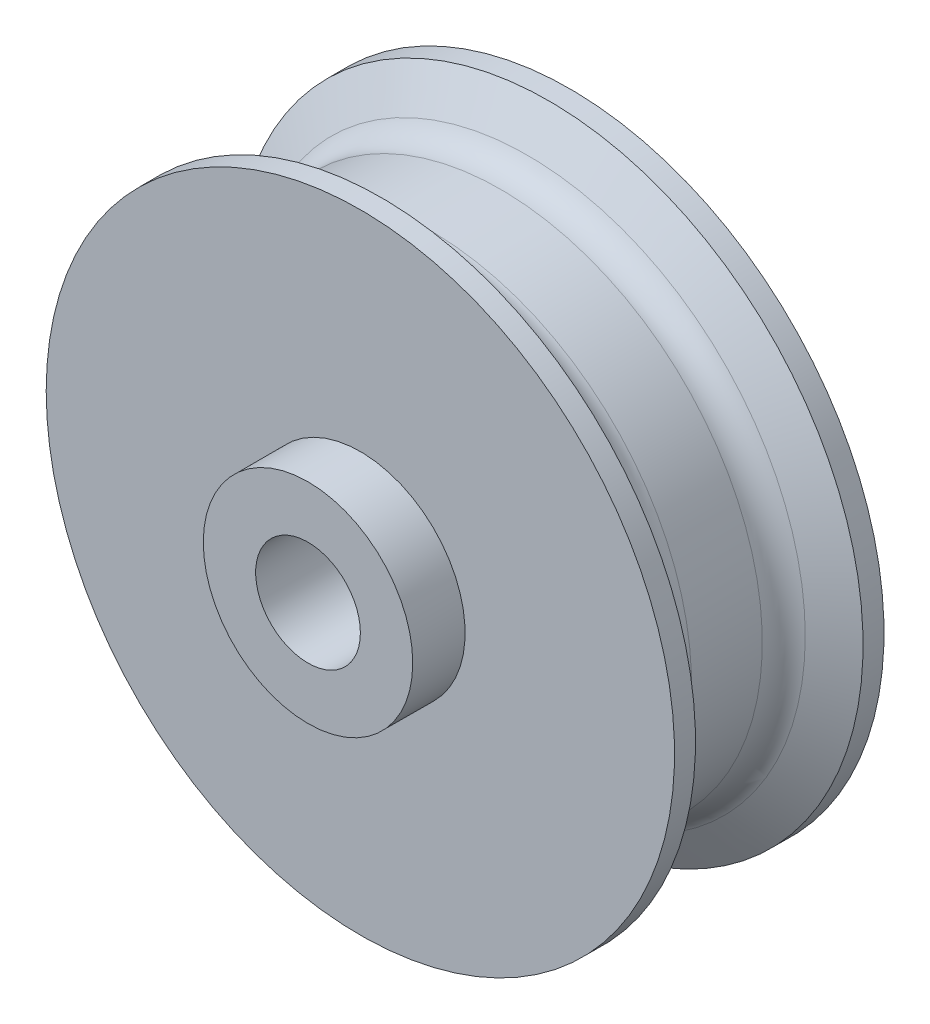
ISO-10303-21;
HEADER;
FILE_DESCRIPTION(('STEP AP214'),'2;1');
FILE_NAME('part.step','',(''),(''),'','','');
FILE_SCHEMA(('AUTOMOTIVE_DESIGN { 1 0 10303 214 1 1 1 1 }'));
ENDSEC;
DATA;
#1=APPLICATION_CONTEXT('core data for automotive mechanical design processes');
#2=APPLICATION_PROTOCOL_DEFINITION('international standard','automotive_design',2000,#1);
#3=PRODUCT_CONTEXT('',#1,'mechanical');
#4=PRODUCT('Part','Part','',(#3));
#5=PRODUCT_RELATED_PRODUCT_CATEGORY('part','',(#4));
#6=PRODUCT_DEFINITION_FORMATION('','',#4);
#7=PRODUCT_DEFINITION_CONTEXT('part definition',#1,'design');
#8=PRODUCT_DEFINITION('design','',#6,#7);
#9=PRODUCT_DEFINITION_SHAPE('','',#8);
#10=(LENGTH_UNIT() NAMED_UNIT(*) SI_UNIT(.MILLI.,.METRE.));
#11=(NAMED_UNIT(*) PLANE_ANGLE_UNIT() SI_UNIT($,.RADIAN.));
#12=(NAMED_UNIT(*) SI_UNIT($,.STERADIAN.) SOLID_ANGLE_UNIT());
#13=UNCERTAINTY_MEASURE_WITH_UNIT(LENGTH_MEASURE(1.E-05),#10,'distance_accuracy_value','');
#14=(GEOMETRIC_REPRESENTATION_CONTEXT(3) GLOBAL_UNCERTAINTY_ASSIGNED_CONTEXT((#13)) GLOBAL_UNIT_ASSIGNED_CONTEXT((#10,
#11,#12)) REPRESENTATION_CONTEXT('',''));
#15=CARTESIAN_POINT('',(0.,0.,0.));
#16=DIRECTION('',(0.,0.,1.));
#17=DIRECTION('',(1.,0.,0.));
#18=AXIS2_PLACEMENT_3D('',#15,#16,#17);
#19=CARTESIAN_POINT('',(0.,0.,30.));
#20=DIRECTION('',(0.,0.,-1.));
#21=DIRECTION('',(-1.,0.,0.));
#22=AXIS2_PLACEMENT_3D('',#19,#20,#21);
#23=CYLINDRICAL_SURFACE('',#22,10.);
#24=CARTESIAN_POINT('',(0.,0.,30.));
#25=DIRECTION('',(0.,0.,1.));
#26=DIRECTION('',(1.,0.,0.));
#27=AXIS2_PLACEMENT_3D('',#24,#25,#26);
#28=CIRCLE('',#27,10.);
#29=CARTESIAN_POINT('',(10.,0.,30.));
#30=VERTEX_POINT('',#29);
#31=EDGE_CURVE('E71',#30,#30,#28,.T.);
#32=ORIENTED_EDGE('',*,*,#31,.F.);
#33=EDGE_LOOP('',(#32));
#34=FACE_BOUND('',#33,.T.);
#35=CARTESIAN_POINT('',(0.,0.,25.));
#36=DIRECTION('',(0.,0.,-1.));
#37=DIRECTION('',(-1.,0.,0.));
#38=AXIS2_PLACEMENT_3D('',#35,#36,#37);
#39=CIRCLE('',#38,10.);
#40=CARTESIAN_POINT('',(-10.,0.,25.));
#41=VERTEX_POINT('',#40);
#42=EDGE_CURVE('E67',#41,#41,#39,.T.);
#43=ORIENTED_EDGE('',*,*,#42,.F.);
#44=EDGE_LOOP('',(#43));
#45=FACE_BOUND('',#44,.T.);
#46=ADVANCED_FACE('F43',(#34,#45),#23,.T.);
#47=CARTESIAN_POINT('',(0.,0.,30.));
#48=DIRECTION('',(0.,0.,1.));
#49=DIRECTION('',(1.,0.,0.));
#50=AXIS2_PLACEMENT_3D('',#47,#48,#49);
#51=PLANE('',#50);
#52=ORIENTED_EDGE('',*,*,#31,.T.);
#53=EDGE_LOOP('',(#52));
#54=FACE_BOUND('',#53,.T.);
#55=CARTESIAN_POINT('',(0.,0.,30.));
#56=DIRECTION('',(0.,0.,1.));
#57=DIRECTION('',(1.,0.,0.));
#58=AXIS2_PLACEMENT_3D('',#55,#56,#57);
#59=CIRCLE('',#58,5.);
#60=CARTESIAN_POINT('',(5.,0.,30.));
#61=VERTEX_POINT('',#60);
#62=EDGE_CURVE('E76',#61,#61,#59,.T.);
#63=ORIENTED_EDGE('',*,*,#62,.F.);
#64=EDGE_LOOP('',(#63));
#65=FACE_BOUND('',#64,.T.);
#66=ADVANCED_FACE('F119',(#54,#65),#51,.T.);
#67=CARTESIAN_POINT('',(0.,0.,0.));
#68=DIRECTION('',(0.,0.,1.));
#69=DIRECTION('',(1.,0.,0.));
#70=AXIS2_PLACEMENT_3D('',#67,#68,#69);
#71=PLANE('',#70);
#72=CARTESIAN_POINT('',(0.,0.,0.));
#73=DIRECTION('',(0.,0.,1.));
#74=DIRECTION('',(1.,0.,0.));
#75=AXIS2_PLACEMENT_3D('',#72,#73,#74);
#76=CIRCLE('',#75,10.);
#77=CARTESIAN_POINT('',(10.,0.,0.));
#78=VERTEX_POINT('',#77);
#79=EDGE_CURVE('E72',#78,#78,#76,.T.);
#80=ORIENTED_EDGE('',*,*,#79,.F.);
#81=EDGE_LOOP('',(#80));
#82=FACE_BOUND('',#81,.T.);
#83=CARTESIAN_POINT('',(0.,0.,0.));
#84=DIRECTION('',(0.,0.,1.));
#85=DIRECTION('',(1.,0.,0.));
#86=AXIS2_PLACEMENT_3D('',#83,#84,#85);
#87=CIRCLE('',#86,5.);
#88=CARTESIAN_POINT('',(5.,0.,0.));
#89=VERTEX_POINT('',#88);
#90=EDGE_CURVE('E80',#89,#89,#87,.T.);
#91=ORIENTED_EDGE('',*,*,#90,.T.);
#92=EDGE_LOOP('',(#91));
#93=FACE_BOUND('',#92,.T.);
#94=ADVANCED_FACE('F126',(#82,#93),#71,.F.);
#95=CARTESIAN_POINT('',(0.,0.,5.));
#96=DIRECTION('',(0.,0.,-1.));
#97=DIRECTION('',(-1.,0.,0.));
#98=AXIS2_PLACEMENT_3D('',#95,#96,#97);
#99=CIRCLE('',#98,10.);
#100=CARTESIAN_POINT('',(-10.,0.,5.));
#101=VERTEX_POINT('',#100);
#102=EDGE_CURVE('E99',#101,#101,#99,.T.);
#103=ORIENTED_EDGE('',*,*,#102,.T.);
#104=EDGE_LOOP('',(#103));
#105=FACE_BOUND('',#104,.T.);
#106=ORIENTED_EDGE('',*,*,#79,.T.);
#107=EDGE_LOOP('',(#106));
#108=FACE_BOUND('',#107,.T.);
#109=ADVANCED_FACE('F122',(#105,#108),#23,.T.);
#110=CARTESIAN_POINT('',(0.,0.,30.));
#111=DIRECTION('',(0.,0.,-1.));
#112=DIRECTION('',(-1.,0.,0.));
#113=AXIS2_PLACEMENT_3D('',#110,#111,#112);
#114=CYLINDRICAL_SURFACE('',#113,5.);
#115=ORIENTED_EDGE('',*,*,#62,.T.);
#116=EDGE_LOOP('',(#115));
#117=FACE_BOUND('',#116,.T.);
#118=ORIENTED_EDGE('',*,*,#90,.F.);
#119=EDGE_LOOP('',(#118));
#120=FACE_BOUND('',#119,.T.);
#121=ADVANCED_FACE('F132',(#117,#120),#114,.F.);
#122=CARTESIAN_POINT('',(0.,0.,0.));
#123=DIRECTION('',(0.,0.,-1.));
#124=DIRECTION('',(-1.,0.,0.));
#125=AXIS2_PLACEMENT_3D('',#122,#123,#124);
#126=CYLINDRICAL_SURFACE('',#125,30.);
#127=CARTESIAN_POINT('',(0.,0.,23.));
#128=DIRECTION('',(0.,0.,-1.));
#129=DIRECTION('',(-1.,0.,0.));
#130=AXIS2_PLACEMENT_3D('',#127,#128,#129);
#131=CIRCLE('',#130,30.);
#132=CARTESIAN_POINT('',(-30.,0.,23.));
#133=VERTEX_POINT('',#132);
#134=EDGE_CURVE('E84',#133,#133,#131,.T.);
#135=ORIENTED_EDGE('',*,*,#134,.F.);
#136=EDGE_LOOP('',(#135));
#137=FACE_BOUND('',#136,.T.);
#138=CARTESIAN_POINT('',(0.,0.,25.));
#139=DIRECTION('',(0.,0.,-1.));
#140=DIRECTION('',(-1.,0.,0.));
#141=AXIS2_PLACEMENT_3D('',#138,#139,#140);
#142=CIRCLE('',#141,30.);
#143=CARTESIAN_POINT('',(-30.,0.,25.));
#144=VERTEX_POINT('',#143);
#145=EDGE_CURVE('E103',#144,#144,#142,.T.);
#146=ORIENTED_EDGE('',*,*,#145,.T.);
#147=EDGE_LOOP('',(#146));
#148=FACE_BOUND('',#147,.T.);
#149=ADVANCED_FACE('F108',(#137,#148),#126,.T.);
#150=CARTESIAN_POINT('',(0.,0.,23.));
#151=DIRECTION('',(0.,0.,1.));
#152=DIRECTION('',(1.,0.,0.));
#153=AXIS2_PLACEMENT_3D('',#150,#151,#152);
#154=CONICAL_SURFACE('',#153,30.,1.0471975511966);
#155=CARTESIAN_POINT('',(0.,0.,20.9792740578363));
#156=DIRECTION('',(0.,0.,-1.));
#157=DIRECTION('',(-1.,0.,0.));
#158=AXIS2_PLACEMENT_3D('',#155,#156,#157);
#159=CIRCLE('',#158,26.5);
#160=CARTESIAN_POINT('',(-26.5,0.,20.9792740578363));
#161=VERTEX_POINT('',#160);
#162=EDGE_CURVE('E51',#161,#161,#159,.F.);
#163=ORIENTED_EDGE('',*,*,#162,.T.);
#164=EDGE_LOOP('',(#163));
#165=FACE_BOUND('',#164,.T.);
#166=ORIENTED_EDGE('',*,*,#134,.T.);
#167=EDGE_LOOP('',(#166));
#168=FACE_BOUND('',#167,.T.);
#169=ADVANCED_FACE('F164',(#165,#168),#154,.T.);
#170=CARTESIAN_POINT('',(0.,0.,0.));
#171=DIRECTION('',(0.,0.,-1.));
#172=DIRECTION('',(-1.,0.,0.));
#173=AXIS2_PLACEMENT_3D('',#170,#171,#172);
#174=CYLINDRICAL_SURFACE('',#173,25.);
#175=CARTESIAN_POINT('',(0.,0.,18.381197846483));
#176=DIRECTION('',(0.,0.,-1.));
#177=DIRECTION('',(-1.,0.,0.));
#178=AXIS2_PLACEMENT_3D('',#175,#176,#177);
#179=CIRCLE('',#178,25.);
#180=CARTESIAN_POINT('',(-25.,0.,18.381197846483));
#181=VERTEX_POINT('',#180);
#182=EDGE_CURVE('E56',#181,#181,#179,.T.);
#183=ORIENTED_EDGE('',*,*,#182,.T.);
#184=EDGE_LOOP('',(#183));
#185=FACE_BOUND('',#184,.T.);
#186=CARTESIAN_POINT('',(0.,0.,11.618802153517));
#187=DIRECTION('',(0.,0.,-1.));
#188=DIRECTION('',(-1.,0.,0.));
#189=AXIS2_PLACEMENT_3D('',#186,#187,#188);
#190=CIRCLE('',#189,25.);
#191=CARTESIAN_POINT('',(-25.,0.,11.618802153517));
#192=VERTEX_POINT('',#191);
#193=EDGE_CURVE('E61',#192,#192,#190,.F.);
#194=ORIENTED_EDGE('',*,*,#193,.T.);
#195=EDGE_LOOP('',(#194));
#196=FACE_BOUND('',#195,.T.);
#197=ADVANCED_FACE('F161',(#185,#196),#174,.T.);
#198=CARTESIAN_POINT('',(0.,0.,7.));
#199=DIRECTION('',(0.,0.,-1.));
#200=DIRECTION('',(-1.,0.,0.));
#201=AXIS2_PLACEMENT_3D('',#198,#199,#200);
#202=CONICAL_SURFACE('',#201,30.,1.0471975511966);
#203=CARTESIAN_POINT('',(0.,0.,9.02072594216368));
#204=DIRECTION('',(0.,0.,-1.));
#205=DIRECTION('',(-1.,0.,0.));
#206=AXIS2_PLACEMENT_3D('',#203,#204,#205);
#207=CIRCLE('',#206,26.5);
#208=CARTESIAN_POINT('',(-26.5,0.,9.02072594216368));
#209=VERTEX_POINT('',#208);
#210=EDGE_CURVE('E10',#209,#209,#207,.T.);
#211=ORIENTED_EDGE('',*,*,#210,.T.);
#212=EDGE_LOOP('',(#211));
#213=FACE_BOUND('',#212,.T.);
#214=CARTESIAN_POINT('',(0.,0.,7.));
#215=DIRECTION('',(0.,0.,-1.));
#216=DIRECTION('',(-1.,0.,0.));
#217=AXIS2_PLACEMENT_3D('',#214,#215,#216);
#218=CIRCLE('',#217,30.);
#219=CARTESIAN_POINT('',(-30.,0.,7.));
#220=VERTEX_POINT('',#219);
#221=EDGE_CURVE('E91',#220,#220,#218,.T.);
#222=ORIENTED_EDGE('',*,*,#221,.F.);
#223=EDGE_LOOP('',(#222));
#224=FACE_BOUND('',#223,.T.);
#225=ADVANCED_FACE('F155',(#213,#224),#202,.T.);
#226=CARTESIAN_POINT('',(0.,0.,0.));
#227=DIRECTION('',(0.,0.,-1.));
#228=DIRECTION('',(-1.,0.,0.));
#229=AXIS2_PLACEMENT_3D('',#226,#227,#228);
#230=CYLINDRICAL_SURFACE('',#229,30.);
#231=ORIENTED_EDGE('',*,*,#221,.T.);
#232=EDGE_LOOP('',(#231));
#233=FACE_BOUND('',#232,.T.);
#234=CARTESIAN_POINT('',(0.,0.,5.));
#235=DIRECTION('',(0.,0.,-1.));
#236=DIRECTION('',(-1.,0.,0.));
#237=AXIS2_PLACEMENT_3D('',#234,#235,#236);
#238=CIRCLE('',#237,30.);
#239=CARTESIAN_POINT('',(-30.,0.,5.));
#240=VERTEX_POINT('',#239);
#241=EDGE_CURVE('E95',#240,#240,#238,.T.);
#242=ORIENTED_EDGE('',*,*,#241,.F.);
#243=EDGE_LOOP('',(#242));
#244=FACE_BOUND('',#243,.T.);
#245=ADVANCED_FACE('F149',(#233,#244),#230,.T.);
#246=CARTESIAN_POINT('',(0.,0.,5.));
#247=DIRECTION('',(0.,0.,-1.));
#248=DIRECTION('',(-1.,0.,0.));
#249=AXIS2_PLACEMENT_3D('',#246,#247,#248);
#250=PLANE('',#249);
#251=ORIENTED_EDGE('',*,*,#241,.T.);
#252=EDGE_LOOP('',(#251));
#253=FACE_BOUND('',#252,.T.);
#254=ORIENTED_EDGE('',*,*,#102,.F.);
#255=EDGE_LOOP('',(#254));
#256=FACE_BOUND('',#255,.T.);
#257=ADVANCED_FACE('F114',(#253,#256),#250,.T.);
#258=CARTESIAN_POINT('',(0.,0.,25.));
#259=DIRECTION('',(0.,0.,-1.));
#260=DIRECTION('',(-1.,0.,0.));
#261=AXIS2_PLACEMENT_3D('',#258,#259,#260);
#262=PLANE('',#261);
#263=ORIENTED_EDGE('',*,*,#145,.F.);
#264=EDGE_LOOP('',(#263));
#265=FACE_BOUND('',#264,.T.);
#266=ORIENTED_EDGE('',*,*,#42,.T.);
#267=EDGE_LOOP('',(#266));
#268=FACE_BOUND('',#267,.T.);
#269=ADVANCED_FACE('F110',(#265,#268),#262,.F.);
#270=CARTESIAN_POINT('',(0.,0.,18.381197846483));
#271=DIRECTION('',(0.,0.,-1.));
#272=DIRECTION('',(-1.,0.,0.));
#273=AXIS2_PLACEMENT_3D('',#270,#271,#272);
#274=TOROIDAL_SURFACE('',#273,28.,3.);
#275=ORIENTED_EDGE('',*,*,#162,.F.);
#276=EDGE_LOOP('',(#275));
#277=FACE_BOUND('',#276,.T.);
#278=ORIENTED_EDGE('',*,*,#182,.F.);
#279=EDGE_LOOP('',(#278));
#280=FACE_BOUND('',#279,.T.);
#281=ADVANCED_FACE('F113',(#277,#280),#274,.F.);
#282=CARTESIAN_POINT('',(0.,0.,11.618802153517));
#283=DIRECTION('',(0.,0.,-1.));
#284=DIRECTION('',(-1.,0.,0.));
#285=AXIS2_PLACEMENT_3D('',#282,#283,#284);
#286=TOROIDAL_SURFACE('',#285,28.,3.);
#287=ORIENTED_EDGE('',*,*,#193,.F.);
#288=EDGE_LOOP('',(#287));
#289=FACE_BOUND('',#288,.T.);
#290=ORIENTED_EDGE('',*,*,#210,.F.);
#291=EDGE_LOOP('',(#290));
#292=FACE_BOUND('',#291,.T.);
#293=ADVANCED_FACE('F45',(#289,#292),#286,.F.);
#294=CLOSED_SHELL('',(#46,#66,#94,#109,#121,#149,#169,#197,#225,#245,#257,#269,#281,#293));
#295=MANIFOLD_SOLID_BREP('B2',#294);
#296=ADVANCED_BREP_SHAPE_REPRESENTATION('',(#18,#295),#14);
#297=SHAPE_DEFINITION_REPRESENTATION(#9,#296);
ENDSEC;
END-ISO-10303-21;
